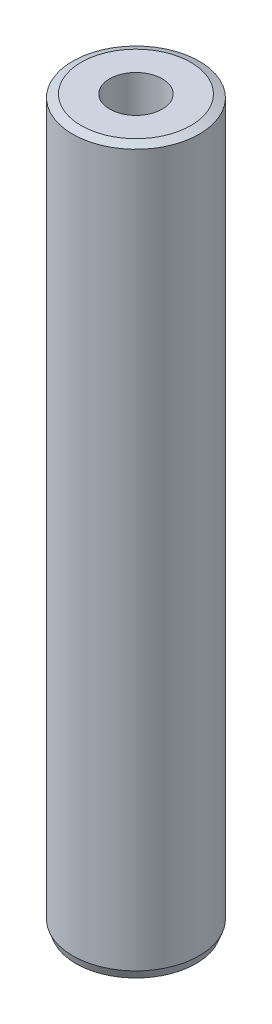
ISO-10303-21;
HEADER;
FILE_DESCRIPTION(('STEP AP214'),'2;1');
FILE_NAME('part.step','',(''),(''),'','','');
FILE_SCHEMA(('AUTOMOTIVE_DESIGN { 1 0 10303 214 1 1 1 1 }'));
ENDSEC;
DATA;
#1=APPLICATION_CONTEXT('core data for automotive mechanical design processes');
#2=APPLICATION_PROTOCOL_DEFINITION('international standard','automotive_design',2000,#1);
#3=PRODUCT_CONTEXT('',#1,'mechanical');
#4=PRODUCT('Part','Part','',(#3));
#5=PRODUCT_RELATED_PRODUCT_CATEGORY('part','',(#4));
#6=PRODUCT_DEFINITION_FORMATION('','',#4);
#7=PRODUCT_DEFINITION_CONTEXT('part definition',#1,'design');
#8=PRODUCT_DEFINITION('design','',#6,#7);
#9=PRODUCT_DEFINITION_SHAPE('','',#8);
#10=(LENGTH_UNIT() NAMED_UNIT(*) SI_UNIT(.MILLI.,.METRE.));
#11=(NAMED_UNIT(*) PLANE_ANGLE_UNIT() SI_UNIT($,.RADIAN.));
#12=(NAMED_UNIT(*) SI_UNIT($,.STERADIAN.) SOLID_ANGLE_UNIT());
#13=UNCERTAINTY_MEASURE_WITH_UNIT(LENGTH_MEASURE(1.E-05),#10,'distance_accuracy_value','');
#14=(GEOMETRIC_REPRESENTATION_CONTEXT(3) GLOBAL_UNCERTAINTY_ASSIGNED_CONTEXT((#13)) GLOBAL_UNIT_ASSIGNED_CONTEXT((#10,
#11,#12)) REPRESENTATION_CONTEXT('',''));
#15=CARTESIAN_POINT('',(0.,0.,0.));
#16=DIRECTION('',(0.,0.,1.));
#17=DIRECTION('',(1.,0.,0.));
#18=AXIS2_PLACEMENT_3D('',#15,#16,#17);
#19=CARTESIAN_POINT('',(0.,600.,0.));
#20=DIRECTION('',(0.,-1.,0.));
#21=DIRECTION('',(0.,0.,-1.));
#22=AXIS2_PLACEMENT_3D('',#19,#20,#21);
#23=CYLINDRICAL_SURFACE('',#22,52.5);
#24=CARTESIAN_POINT('',(0.,597.327973509158,0.));
#25=DIRECTION('',(0.,1.,0.));
#26=DIRECTION('',(0.,0.,1.));
#27=AXIS2_PLACEMENT_3D('',#24,#25,#26);
#28=CIRCLE('',#27,52.5);
#29=CARTESIAN_POINT('',(0.,597.327973509158,52.5));
#30=VERTEX_POINT('',#29);
#31=EDGE_CURVE('E50',#30,#30,#28,.F.);
#32=ORIENTED_EDGE('',*,*,#31,.T.);
#33=EDGE_LOOP('',(#32));
#34=FACE_BOUND('',#33,.T.);
#35=CARTESIAN_POINT('',(0.,7.00087900085422,0.));
#36=DIRECTION('',(0.,1.,0.));
#37=DIRECTION('',(0.,0.,1.));
#38=AXIS2_PLACEMENT_3D('',#35,#36,#37);
#39=CIRCLE('',#38,52.5);
#40=CARTESIAN_POINT('',(0.,7.00087900085422,52.5));
#41=VERTEX_POINT('',#40);
#42=EDGE_CURVE('E51',#41,#41,#39,.T.);
#43=ORIENTED_EDGE('',*,*,#42,.T.);
#44=EDGE_LOOP('',(#43));
#45=FACE_BOUND('',#44,.T.);
#46=ADVANCED_FACE('F39',(#34,#45),#23,.T.);
#47=CARTESIAN_POINT('',(0.,600.,0.));
#48=DIRECTION('',(0.,1.,0.));
#49=DIRECTION('',(0.,0.,1.));
#50=AXIS2_PLACEMENT_3D('',#47,#48,#49);
#51=PLANE('',#50);
#52=CARTESIAN_POINT('',(0.,600.,0.));
#53=DIRECTION('',(0.,1.,0.));
#54=DIRECTION('',(0.,0.,1.));
#55=AXIS2_PLACEMENT_3D('',#52,#53,#54);
#56=CIRCLE('',#55,45.4991209991452);
#57=CARTESIAN_POINT('',(0.,600.,45.4991209991452));
#58=VERTEX_POINT('',#57);
#59=EDGE_CURVE('E54',#58,#58,#56,.T.);
#60=ORIENTED_EDGE('',*,*,#59,.T.);
#61=EDGE_LOOP('',(#60));
#62=FACE_BOUND('',#61,.T.);
#63=CARTESIAN_POINT('',(0.,600.,0.));
#64=DIRECTION('',(0.,1.,0.));
#65=DIRECTION('',(0.,0.,1.));
#66=AXIS2_PLACEMENT_3D('',#63,#64,#65);
#67=CIRCLE('',#66,21.8333474845606);
#68=CARTESIAN_POINT('',(0.,600.,21.8333474845606));
#69=VERTEX_POINT('',#68);
#70=EDGE_CURVE('E58',#69,#69,#67,.T.);
#71=ORIENTED_EDGE('',*,*,#70,.F.);
#72=EDGE_LOOP('',(#71));
#73=FACE_BOUND('',#72,.T.);
#74=ADVANCED_FACE('F69',(#62,#73),#51,.T.);
#75=CARTESIAN_POINT('',(0.,0.,0.));
#76=DIRECTION('',(0.,1.,0.));
#77=DIRECTION('',(0.,0.,1.));
#78=AXIS2_PLACEMENT_3D('',#75,#76,#77);
#79=PLANE('',#78);
#80=CARTESIAN_POINT('',(0.,0.,0.));
#81=DIRECTION('',(0.,1.,0.));
#82=DIRECTION('',(0.,0.,1.));
#83=AXIS2_PLACEMENT_3D('',#80,#81,#82);
#84=CIRCLE('',#83,49.8279735091585);
#85=CARTESIAN_POINT('',(0.,0.,49.8279735091585));
#86=VERTEX_POINT('',#85);
#87=EDGE_CURVE('E10',#86,#86,#84,.F.);
#88=ORIENTED_EDGE('',*,*,#87,.T.);
#89=EDGE_LOOP('',(#88));
#90=FACE_BOUND('',#89,.T.);
#91=CARTESIAN_POINT('',(0.,0.,0.));
#92=DIRECTION('',(0.,1.,0.));
#93=DIRECTION('',(0.,0.,1.));
#94=AXIS2_PLACEMENT_3D('',#91,#92,#93);
#95=CIRCLE('',#94,21.8333474845606);
#96=CARTESIAN_POINT('',(0.,0.,21.8333474845606));
#97=VERTEX_POINT('',#96);
#98=EDGE_CURVE('E63',#97,#97,#95,.T.);
#99=ORIENTED_EDGE('',*,*,#98,.T.);
#100=EDGE_LOOP('',(#99));
#101=FACE_BOUND('',#100,.T.);
#102=ADVANCED_FACE('F75',(#90,#101),#79,.F.);
#103=CARTESIAN_POINT('',(0.,600.,0.));
#104=DIRECTION('',(0.,-1.,0.));
#105=DIRECTION('',(0.,0.,-1.));
#106=AXIS2_PLACEMENT_3D('',#103,#104,#105);
#107=CYLINDRICAL_SURFACE('',#106,21.8333474845606);
#108=ORIENTED_EDGE('',*,*,#70,.T.);
#109=EDGE_LOOP('',(#108));
#110=FACE_BOUND('',#109,.T.);
#111=ORIENTED_EDGE('',*,*,#98,.F.);
#112=EDGE_LOOP('',(#111));
#113=FACE_BOUND('',#112,.T.);
#114=ADVANCED_FACE('F70',(#110,#113),#107,.F.);
#115=CARTESIAN_POINT('',(0.,600.,0.));
#116=DIRECTION('',(0.,-1.,0.));
#117=DIRECTION('',(0.,0.,-1.));
#118=AXIS2_PLACEMENT_3D('',#115,#116,#117);
#119=CONICAL_SURFACE('',#118,45.4991209991452,1.206190721672);
#120=ORIENTED_EDGE('',*,*,#31,.F.);
#121=EDGE_LOOP('',(#120));
#122=FACE_BOUND('',#121,.T.);
#123=ORIENTED_EDGE('',*,*,#59,.F.);
#124=EDGE_LOOP('',(#123));
#125=FACE_BOUND('',#124,.T.);
#126=ADVANCED_FACE('F81',(#122,#125),#119,.T.);
#127=CARTESIAN_POINT('',(0.,7.00087900085422,0.));
#128=DIRECTION('',(0.,1.,0.));
#129=DIRECTION('',(0.,0.,1.));
#130=AXIS2_PLACEMENT_3D('',#127,#128,#129);
#131=CONICAL_SURFACE('',#130,52.5,0.364605605122892);
#132=ORIENTED_EDGE('',*,*,#87,.F.);
#133=EDGE_LOOP('',(#132));
#134=FACE_BOUND('',#133,.T.);
#135=ORIENTED_EDGE('',*,*,#42,.F.);
#136=EDGE_LOOP('',(#135));
#137=FACE_BOUND('',#136,.T.);
#138=ADVANCED_FACE('F45',(#134,#137),#131,.T.);
#139=CLOSED_SHELL('',(#46,#74,#102,#114,#126,#138));
#140=MANIFOLD_SOLID_BREP('B2',#139);
#141=ADVANCED_BREP_SHAPE_REPRESENTATION('',(#18,#140),#14);
#142=SHAPE_DEFINITION_REPRESENTATION(#9,#141);
ENDSEC;
END-ISO-10303-21;
